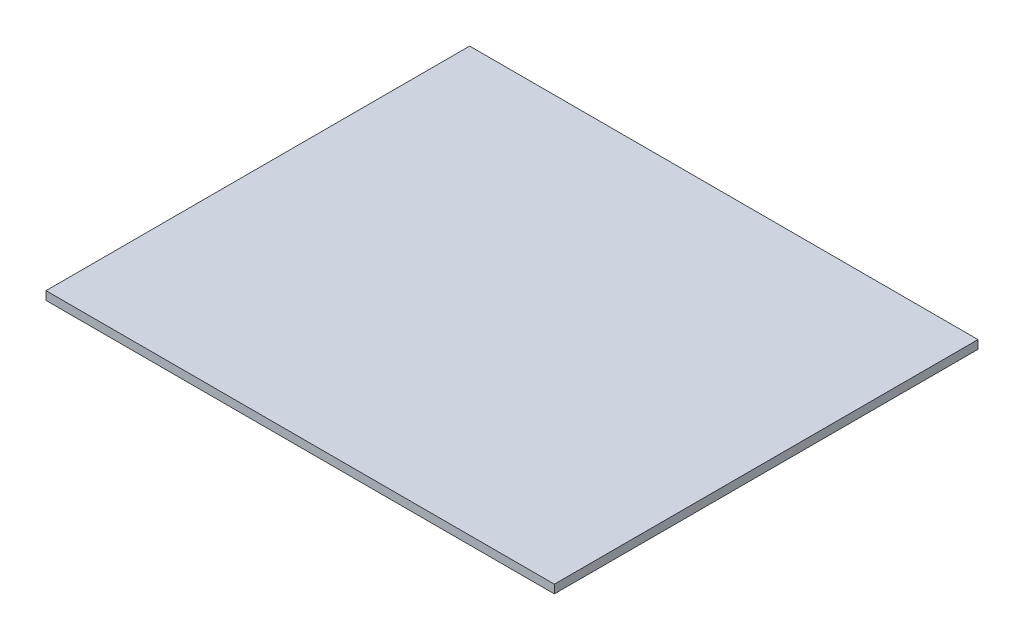
ISO-10303-21;
HEADER;
FILE_DESCRIPTION(('STEP AP214'),'2;1');
FILE_NAME('part.step','',(''),(''),'','','');
FILE_SCHEMA(('AUTOMOTIVE_DESIGN { 1 0 10303 214 1 1 1 1 }'));
ENDSEC;
DATA;
#1=APPLICATION_CONTEXT('core data for automotive mechanical design processes');
#2=APPLICATION_PROTOCOL_DEFINITION('international standard','automotive_design',2000,#1);
#3=PRODUCT_CONTEXT('',#1,'mechanical');
#4=PRODUCT('Part','Part','',(#3));
#5=PRODUCT_RELATED_PRODUCT_CATEGORY('part','',(#4));
#6=PRODUCT_DEFINITION_FORMATION('','',#4);
#7=PRODUCT_DEFINITION_CONTEXT('part definition',#1,'design');
#8=PRODUCT_DEFINITION('design','',#6,#7);
#9=PRODUCT_DEFINITION_SHAPE('','',#8);
#10=(LENGTH_UNIT() NAMED_UNIT(*) SI_UNIT(.MILLI.,.METRE.));
#11=(NAMED_UNIT(*) PLANE_ANGLE_UNIT() SI_UNIT($,.RADIAN.));
#12=(NAMED_UNIT(*) SI_UNIT($,.STERADIAN.) SOLID_ANGLE_UNIT());
#13=UNCERTAINTY_MEASURE_WITH_UNIT(LENGTH_MEASURE(1.E-05),#10,'distance_accuracy_value','');
#14=(GEOMETRIC_REPRESENTATION_CONTEXT(3) GLOBAL_UNCERTAINTY_ASSIGNED_CONTEXT((#13)) GLOBAL_UNIT_ASSIGNED_CONTEXT((#10,
#11,#12)) REPRESENTATION_CONTEXT('',''));
#15=CARTESIAN_POINT('',(0.,0.,0.));
#16=DIRECTION('',(0.,0.,1.));
#17=DIRECTION('',(1.,0.,0.));
#18=AXIS2_PLACEMENT_3D('',#15,#16,#17);
#19=CARTESIAN_POINT('',(-76.2,2.54,-63.5));
#20=DIRECTION('',(1.,0.,0.));
#21=DIRECTION('',(0.,0.,-1.));
#22=AXIS2_PLACEMENT_3D('',#19,#20,#21);
#23=PLANE('',#22);
#24=DIRECTION('',(0.,0.,1.));
#25=VECTOR('',#24,1.);
#26=CARTESIAN_POINT('',(-76.2,0.,-63.5));
#27=LINE('',#26,#25);
#28=CARTESIAN_POINT('',(-76.2,0.,-63.5));
#29=VERTEX_POINT('',#28);
#30=CARTESIAN_POINT('',(-76.2,0.,63.5));
#31=VERTEX_POINT('',#30);
#32=EDGE_CURVE('E95',#29,#31,#27,.T.);
#33=ORIENTED_EDGE('',*,*,#32,.T.);
#34=DIRECTION('',(0.,-1.,0.));
#35=VECTOR('',#34,1.);
#36=CARTESIAN_POINT('',(-76.2,2.54,63.5));
#37=LINE('',#36,#35);
#38=CARTESIAN_POINT('',(-76.2,2.54,63.5));
#39=VERTEX_POINT('',#38);
#40=EDGE_CURVE('E11',#39,#31,#37,.T.);
#41=ORIENTED_EDGE('',*,*,#40,.F.);
#42=DIRECTION('',(0.,0.,1.));
#43=VECTOR('',#42,1.);
#44=CARTESIAN_POINT('',(-76.2,2.54,-63.5));
#45=LINE('',#44,#43);
#46=CARTESIAN_POINT('',(-76.2,2.54,-63.5));
#47=VERTEX_POINT('',#46);
#48=EDGE_CURVE('E83',#47,#39,#45,.T.);
#49=ORIENTED_EDGE('',*,*,#48,.F.);
#50=DIRECTION('',(0.,-1.,0.));
#51=VECTOR('',#50,1.);
#52=CARTESIAN_POINT('',(-76.2,2.54,-63.5));
#53=LINE('',#52,#51);
#54=EDGE_CURVE('E91',#47,#29,#53,.T.);
#55=ORIENTED_EDGE('',*,*,#54,.T.);
#56=EDGE_LOOP('',(#33,#41,#49,#55));
#57=FACE_BOUND('',#56,.T.);
#58=ADVANCED_FACE('F32',(#57),#23,.F.);
#59=CARTESIAN_POINT('',(76.2,2.54,63.5));
#60=DIRECTION('',(0.,0.,-1.));
#61=DIRECTION('',(-1.,0.,0.));
#62=AXIS2_PLACEMENT_3D('',#59,#60,#61);
#63=PLANE('',#62);
#64=DIRECTION('',(1.,0.,0.));
#65=VECTOR('',#64,1.);
#66=CARTESIAN_POINT('',(76.2,0.,63.5));
#67=LINE('',#66,#65);
#68=CARTESIAN_POINT('',(76.2,0.,63.5));
#69=VERTEX_POINT('',#68);
#70=EDGE_CURVE('E87',#31,#69,#67,.T.);
#71=ORIENTED_EDGE('',*,*,#70,.T.);
#72=DIRECTION('',(0.,-1.,0.));
#73=VECTOR('',#72,1.);
#74=CARTESIAN_POINT('',(76.2,2.54,63.5));
#75=LINE('',#74,#73);
#76=CARTESIAN_POINT('',(76.2,2.54,63.5));
#77=VERTEX_POINT('',#76);
#78=EDGE_CURVE('E40',#77,#69,#75,.T.);
#79=ORIENTED_EDGE('',*,*,#78,.F.);
#80=DIRECTION('',(1.,0.,0.));
#81=VECTOR('',#80,1.);
#82=CARTESIAN_POINT('',(76.2,2.54,63.5));
#83=LINE('',#82,#81);
#84=EDGE_CURVE('E78',#39,#77,#83,.T.);
#85=ORIENTED_EDGE('',*,*,#84,.F.);
#86=ORIENTED_EDGE('',*,*,#40,.T.);
#87=EDGE_LOOP('',(#71,#79,#85,#86));
#88=FACE_BOUND('',#87,.T.);
#89=ADVANCED_FACE('F86',(#88),#63,.F.);
#90=CARTESIAN_POINT('',(76.2,2.54,-63.5));
#91=DIRECTION('',(-1.,0.,0.));
#92=DIRECTION('',(0.,0.,1.));
#93=AXIS2_PLACEMENT_3D('',#90,#91,#92);
#94=PLANE('',#93);
#95=DIRECTION('',(0.,0.,-1.));
#96=VECTOR('',#95,1.);
#97=CARTESIAN_POINT('',(76.2,0.,-63.5));
#98=LINE('',#97,#96);
#99=CARTESIAN_POINT('',(76.2,0.,-63.5));
#100=VERTEX_POINT('',#99);
#101=EDGE_CURVE('E65',#69,#100,#98,.T.);
#102=ORIENTED_EDGE('',*,*,#101,.T.);
#103=DIRECTION('',(0.,-1.,0.));
#104=VECTOR('',#103,1.);
#105=CARTESIAN_POINT('',(76.2,2.54,-63.5));
#106=LINE('',#105,#104);
#107=CARTESIAN_POINT('',(76.2,2.54,-63.5));
#108=VERTEX_POINT('',#107);
#109=EDGE_CURVE('E88',#108,#100,#106,.T.);
#110=ORIENTED_EDGE('',*,*,#109,.F.);
#111=DIRECTION('',(0.,0.,-1.));
#112=VECTOR('',#111,1.);
#113=CARTESIAN_POINT('',(76.2,2.54,-63.5));
#114=LINE('',#113,#112);
#115=EDGE_CURVE('E81',#77,#108,#114,.T.);
#116=ORIENTED_EDGE('',*,*,#115,.F.);
#117=ORIENTED_EDGE('',*,*,#78,.T.);
#118=EDGE_LOOP('',(#102,#110,#116,#117));
#119=FACE_BOUND('',#118,.T.);
#120=ADVANCED_FACE('F89',(#119),#94,.F.);
#121=CARTESIAN_POINT('',(76.2,2.54,-63.5));
#122=DIRECTION('',(0.,0.,1.));
#123=DIRECTION('',(1.,0.,0.));
#124=AXIS2_PLACEMENT_3D('',#121,#122,#123);
#125=PLANE('',#124);
#126=DIRECTION('',(-1.,0.,0.));
#127=VECTOR('',#126,1.);
#128=CARTESIAN_POINT('',(76.2,0.,-63.5));
#129=LINE('',#128,#127);
#130=EDGE_CURVE('E71',#100,#29,#129,.T.);
#131=ORIENTED_EDGE('',*,*,#130,.T.);
#132=ORIENTED_EDGE('',*,*,#54,.F.);
#133=DIRECTION('',(-1.,0.,0.));
#134=VECTOR('',#133,1.);
#135=CARTESIAN_POINT('',(76.2,2.54,-63.5));
#136=LINE('',#135,#134);
#137=EDGE_CURVE('E48',#108,#47,#136,.T.);
#138=ORIENTED_EDGE('',*,*,#137,.F.);
#139=ORIENTED_EDGE('',*,*,#109,.T.);
#140=EDGE_LOOP('',(#131,#132,#138,#139));
#141=FACE_BOUND('',#140,.T.);
#142=ADVANCED_FACE('F102',(#141),#125,.F.);
#143=CARTESIAN_POINT('',(0.,2.54,0.));
#144=DIRECTION('',(0.,-1.,0.));
#145=DIRECTION('',(0.,0.,-1.));
#146=AXIS2_PLACEMENT_3D('',#143,#144,#145);
#147=PLANE('',#146);
#148=ORIENTED_EDGE('',*,*,#48,.T.);
#149=ORIENTED_EDGE('',*,*,#84,.T.);
#150=ORIENTED_EDGE('',*,*,#115,.T.);
#151=ORIENTED_EDGE('',*,*,#137,.T.);
#152=EDGE_LOOP('',(#148,#149,#150,#151));
#153=FACE_BOUND('',#152,.T.);
#154=ADVANCED_FACE('F79',(#153),#147,.F.);
#155=CARTESIAN_POINT('',(0.,0.,0.));
#156=DIRECTION('',(0.,-1.,0.));
#157=DIRECTION('',(0.,0.,-1.));
#158=AXIS2_PLACEMENT_3D('',#155,#156,#157);
#159=PLANE('',#158);
#160=ORIENTED_EDGE('',*,*,#32,.F.);
#161=ORIENTED_EDGE('',*,*,#130,.F.);
#162=ORIENTED_EDGE('',*,*,#101,.F.);
#163=ORIENTED_EDGE('',*,*,#70,.F.);
#164=EDGE_LOOP('',(#160,#161,#162,#163));
#165=FACE_BOUND('',#164,.T.);
#166=ADVANCED_FACE('F105',(#165),#159,.T.);
#167=CLOSED_SHELL('',(#58,#89,#120,#142,#154,#166));
#168=MANIFOLD_SOLID_BREP('B2',#167);
#169=ADVANCED_BREP_SHAPE_REPRESENTATION('',(#18,#168),#14);
#170=SHAPE_DEFINITION_REPRESENTATION(#9,#169);
ENDSEC;
END-ISO-10303-21;
